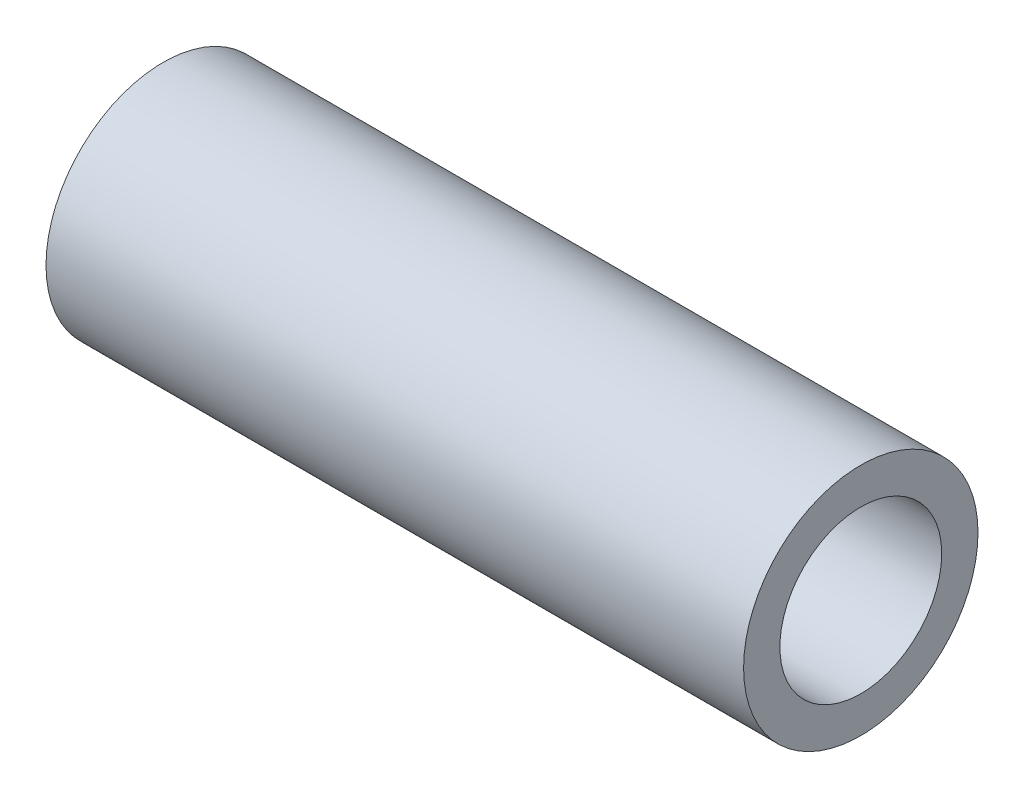
ISO-10303-21;
HEADER;
FILE_DESCRIPTION(('STEP AP214'),'2;1');
FILE_NAME('part.step','',(''),(''),'','','');
FILE_SCHEMA(('AUTOMOTIVE_DESIGN { 1 0 10303 214 1 1 1 1 }'));
ENDSEC;
DATA;
#1=APPLICATION_CONTEXT('core data for automotive mechanical design processes');
#2=APPLICATION_PROTOCOL_DEFINITION('international standard','automotive_design',2000,#1);
#3=PRODUCT_CONTEXT('',#1,'mechanical');
#4=PRODUCT('Part','Part','',(#3));
#5=PRODUCT_RELATED_PRODUCT_CATEGORY('part','',(#4));
#6=PRODUCT_DEFINITION_FORMATION('','',#4);
#7=PRODUCT_DEFINITION_CONTEXT('part definition',#1,'design');
#8=PRODUCT_DEFINITION('design','',#6,#7);
#9=PRODUCT_DEFINITION_SHAPE('','',#8);
#10=(LENGTH_UNIT() NAMED_UNIT(*) SI_UNIT(.MILLI.,.METRE.));
#11=(NAMED_UNIT(*) PLANE_ANGLE_UNIT() SI_UNIT($,.RADIAN.));
#12=(NAMED_UNIT(*) SI_UNIT($,.STERADIAN.) SOLID_ANGLE_UNIT());
#13=UNCERTAINTY_MEASURE_WITH_UNIT(LENGTH_MEASURE(1.E-05),#10,'distance_accuracy_value','');
#14=(GEOMETRIC_REPRESENTATION_CONTEXT(3) GLOBAL_UNCERTAINTY_ASSIGNED_CONTEXT((#13)) GLOBAL_UNIT_ASSIGNED_CONTEXT((#10,
#11,#12)) REPRESENTATION_CONTEXT('',''));
#15=CARTESIAN_POINT('',(0.,0.,0.));
#16=DIRECTION('',(0.,0.,1.));
#17=DIRECTION('',(1.,0.,0.));
#18=AXIS2_PLACEMENT_3D('',#15,#16,#17);
#19=CARTESIAN_POINT('',(-63.5,0.,0.));
#20=DIRECTION('',(1.,0.,0.));
#21=DIRECTION('',(0.,0.,-1.));
#22=AXIS2_PLACEMENT_3D('',#19,#20,#21);
#23=CYLINDRICAL_SURFACE('',#22,10.668);
#24=CARTESIAN_POINT('',(-63.5,0.,0.));
#25=DIRECTION('',(1.,0.,0.));
#26=DIRECTION('',(0.,0.,-1.));
#27=AXIS2_PLACEMENT_3D('',#24,#25,#26);
#28=CIRCLE('',#27,10.668);
#29=CARTESIAN_POINT('',(-63.5,0.,-10.668));
#30=VERTEX_POINT('',#29);
#31=EDGE_CURVE('E10',#30,#30,#28,.T.);
#32=ORIENTED_EDGE('',*,*,#31,.T.);
#33=EDGE_LOOP('',(#32));
#34=FACE_BOUND('',#33,.T.);
#35=CARTESIAN_POINT('',(0.,0.,0.));
#36=DIRECTION('',(1.,0.,0.));
#37=DIRECTION('',(0.,0.,-1.));
#38=AXIS2_PLACEMENT_3D('',#35,#36,#37);
#39=CIRCLE('',#38,10.668);
#40=CARTESIAN_POINT('',(0.,0.,-10.668));
#41=VERTEX_POINT('',#40);
#42=EDGE_CURVE('E36',#41,#41,#39,.T.);
#43=ORIENTED_EDGE('',*,*,#42,.F.);
#44=EDGE_LOOP('',(#43));
#45=FACE_BOUND('',#44,.T.);
#46=ADVANCED_FACE('F33',(#34,#45),#23,.T.);
#47=CARTESIAN_POINT('',(-63.5,0.,0.));
#48=DIRECTION('',(1.,0.,0.));
#49=DIRECTION('',(0.,0.,-1.));
#50=AXIS2_PLACEMENT_3D('',#47,#48,#49);
#51=PLANE('',#50);
#52=CARTESIAN_POINT('',(-63.5,0.,0.));
#53=DIRECTION('',(1.,0.,0.));
#54=DIRECTION('',(0.,0.,-1.));
#55=AXIS2_PLACEMENT_3D('',#52,#53,#54);
#56=CIRCLE('',#55,7.366);
#57=CARTESIAN_POINT('',(-63.5,0.,-7.366));
#58=VERTEX_POINT('',#57);
#59=EDGE_CURVE('E43',#58,#58,#56,.T.);
#60=ORIENTED_EDGE('',*,*,#59,.T.);
#61=EDGE_LOOP('',(#60));
#62=FACE_BOUND('',#61,.T.);
#63=ORIENTED_EDGE('',*,*,#31,.F.);
#64=EDGE_LOOP('',(#63));
#65=FACE_BOUND('',#64,.T.);
#66=ADVANCED_FACE('F51',(#62,#65),#51,.F.);
#67=CARTESIAN_POINT('',(0.,0.,0.));
#68=DIRECTION('',(1.,0.,0.));
#69=DIRECTION('',(0.,0.,-1.));
#70=AXIS2_PLACEMENT_3D('',#67,#68,#69);
#71=PLANE('',#70);
#72=CARTESIAN_POINT('',(0.,0.,0.));
#73=DIRECTION('',(1.,0.,0.));
#74=DIRECTION('',(0.,0.,-1.));
#75=AXIS2_PLACEMENT_3D('',#72,#73,#74);
#76=CIRCLE('',#75,7.366);
#77=CARTESIAN_POINT('',(0.,0.,-7.366));
#78=VERTEX_POINT('',#77);
#79=EDGE_CURVE('E45',#78,#78,#76,.T.);
#80=ORIENTED_EDGE('',*,*,#79,.F.);
#81=EDGE_LOOP('',(#80));
#82=FACE_BOUND('',#81,.T.);
#83=ORIENTED_EDGE('',*,*,#42,.T.);
#84=EDGE_LOOP('',(#83));
#85=FACE_BOUND('',#84,.T.);
#86=ADVANCED_FACE('F57',(#82,#85),#71,.T.);
#87=CARTESIAN_POINT('',(-63.5,0.,0.));
#88=DIRECTION('',(1.,0.,0.));
#89=DIRECTION('',(0.,0.,-1.));
#90=AXIS2_PLACEMENT_3D('',#87,#88,#89);
#91=CYLINDRICAL_SURFACE('',#90,7.366);
#92=ORIENTED_EDGE('',*,*,#59,.F.);
#93=EDGE_LOOP('',(#92));
#94=FACE_BOUND('',#93,.T.);
#95=ORIENTED_EDGE('',*,*,#79,.T.);
#96=EDGE_LOOP('',(#95));
#97=FACE_BOUND('',#96,.T.);
#98=ADVANCED_FACE('F54',(#94,#97),#91,.F.);
#99=CLOSED_SHELL('',(#46,#66,#86,#98));
#100=MANIFOLD_SOLID_BREP('B2',#99);
#101=ADVANCED_BREP_SHAPE_REPRESENTATION('',(#18,#100),#14);
#102=SHAPE_DEFINITION_REPRESENTATION(#9,#101);
ENDSEC;
END-ISO-10303-21;
